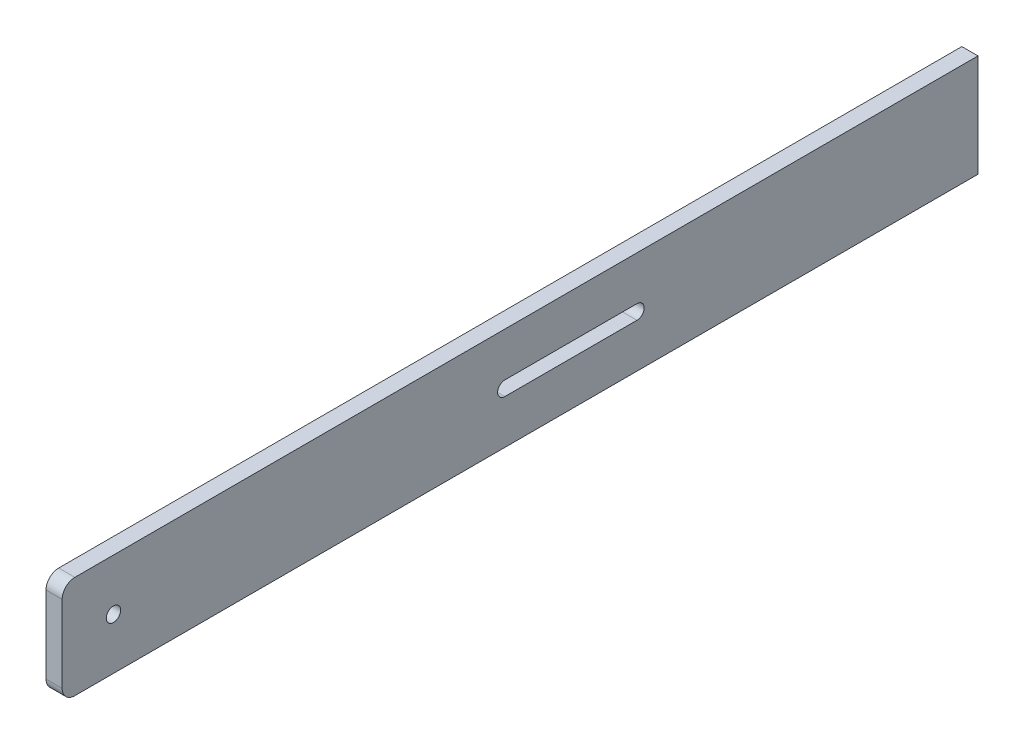
ISO-10303-21;
HEADER;
FILE_DESCRIPTION(('STEP AP214'),'2;1');
FILE_NAME('part.step','',(''),(''),'','','');
FILE_SCHEMA(('AUTOMOTIVE_DESIGN { 1 0 10303 214 1 1 1 1 }'));
ENDSEC;
DATA;
#1=APPLICATION_CONTEXT('core data for automotive mechanical design processes');
#2=APPLICATION_PROTOCOL_DEFINITION('international standard','automotive_design',2000,#1);
#3=PRODUCT_CONTEXT('',#1,'mechanical');
#4=PRODUCT('Part','Part','',(#3));
#5=PRODUCT_RELATED_PRODUCT_CATEGORY('part','',(#4));
#6=PRODUCT_DEFINITION_FORMATION('','',#4);
#7=PRODUCT_DEFINITION_CONTEXT('part definition',#1,'design');
#8=PRODUCT_DEFINITION('design','',#6,#7);
#9=PRODUCT_DEFINITION_SHAPE('','',#8);
#10=(LENGTH_UNIT() NAMED_UNIT(*) SI_UNIT(.MILLI.,.METRE.));
#11=(NAMED_UNIT(*) PLANE_ANGLE_UNIT() SI_UNIT($,.RADIAN.));
#12=(NAMED_UNIT(*) SI_UNIT($,.STERADIAN.) SOLID_ANGLE_UNIT());
#13=UNCERTAINTY_MEASURE_WITH_UNIT(LENGTH_MEASURE(1.E-05),#10,'distance_accuracy_value','');
#14=(GEOMETRIC_REPRESENTATION_CONTEXT(3) GLOBAL_UNCERTAINTY_ASSIGNED_CONTEXT((#13)) GLOBAL_UNIT_ASSIGNED_CONTEXT((#10,
#11,#12)) REPRESENTATION_CONTEXT('',''));
#15=CARTESIAN_POINT('',(0.,0.,0.));
#16=DIRECTION('',(0.,0.,1.));
#17=DIRECTION('',(1.,0.,0.));
#18=AXIS2_PLACEMENT_3D('',#15,#16,#17);
#19=CARTESIAN_POINT('',(1.5875,10.085,180.17));
#20=DIRECTION('',(-1.,0.,0.));
#21=DIRECTION('',(0.,-1.,0.));
#22=AXIS2_PLACEMENT_3D('',#19,#20,#21);
#23=PLANE('',#22);
#24=DIRECTION('',(0.,0.,-1.));
#25=VECTOR('',#24,1.);
#26=CARTESIAN_POINT('',(1.5875,1.415,180.17));
#27=LINE('',#26,#25);
#28=CARTESIAN_POINT('',(1.5875,1.415,93.085));
#29=VERTEX_POINT('',#28);
#30=CARTESIAN_POINT('',(1.5875,1.415,67.085));
#31=VERTEX_POINT('',#30);
#32=EDGE_CURVE('E296',#29,#31,#27,.T.);
#33=ORIENTED_EDGE('',*,*,#32,.T.);
#34=CARTESIAN_POINT('',(1.5875,0.,67.085));
#35=DIRECTION('',(-1.,0.,0.));
#36=DIRECTION('',(0.,-1.,0.));
#37=AXIS2_PLACEMENT_3D('',#34,#35,#36);
#38=CIRCLE('',#37,1.415);
#39=CARTESIAN_POINT('',(1.5875,-1.415,67.085));
#40=VERTEX_POINT('',#39);
#41=EDGE_CURVE('E166',#31,#40,#38,.T.);
#42=ORIENTED_EDGE('',*,*,#41,.T.);
#43=DIRECTION('',(0.,0.,1.));
#44=VECTOR('',#43,1.);
#45=CARTESIAN_POINT('',(1.5875,-1.415,180.17));
#46=LINE('',#45,#44);
#47=CARTESIAN_POINT('',(1.5875,-1.415,93.085));
#48=VERTEX_POINT('',#47);
#49=EDGE_CURVE('E301',#40,#48,#46,.T.);
#50=ORIENTED_EDGE('',*,*,#49,.T.);
#51=CARTESIAN_POINT('',(1.5875,0.,93.085));
#52=DIRECTION('',(-1.,0.,0.));
#53=DIRECTION('',(0.,-1.,0.));
#54=AXIS2_PLACEMENT_3D('',#51,#52,#53);
#55=CIRCLE('',#54,1.415);
#56=EDGE_CURVE('E125',#48,#29,#55,.T.);
#57=ORIENTED_EDGE('',*,*,#56,.T.);
#58=EDGE_LOOP('',(#33,#42,#50,#57));
#59=FACE_BOUND('',#58,.T.);
#60=CARTESIAN_POINT('',(1.5875,0.,170.08));
#61=DIRECTION('',(1.,0.,0.));
#62=DIRECTION('',(0.,0.,-1.));
#63=AXIS2_PLACEMENT_3D('',#60,#61,#62);
#64=CIRCLE('',#63,1.415);
#65=CARTESIAN_POINT('',(1.5875,0.,168.665));
#66=VERTEX_POINT('',#65);
#67=EDGE_CURVE('E165',#66,#66,#64,.T.);
#68=ORIENTED_EDGE('',*,*,#67,.F.);
#69=EDGE_LOOP('',(#68));
#70=FACE_BOUND('',#69,.T.);
#71=DIRECTION('',(0.,1.,0.));
#72=VECTOR('',#71,1.);
#73=CARTESIAN_POINT('',(1.5875,10.085,180.17));
#74=LINE('',#73,#72);
#75=CARTESIAN_POINT('',(1.5875,-7.585,180.17));
#76=VERTEX_POINT('',#75);
#77=CARTESIAN_POINT('',(1.5875,7.585,180.17));
#78=VERTEX_POINT('',#77);
#79=EDGE_CURVE('E171',#76,#78,#74,.T.);
#80=ORIENTED_EDGE('',*,*,#79,.F.);
#81=CARTESIAN_POINT('',(1.5875,-7.585,177.67));
#82=DIRECTION('',(-1.,0.,0.));
#83=DIRECTION('',(0.,-1.,0.));
#84=AXIS2_PLACEMENT_3D('',#81,#82,#83);
#85=CIRCLE('',#84,2.5);
#86=CARTESIAN_POINT('',(1.5875,-10.085,177.67));
#87=VERTEX_POINT('',#86);
#88=EDGE_CURVE('E205',#76,#87,#85,.F.);
#89=ORIENTED_EDGE('',*,*,#88,.T.);
#90=DIRECTION('',(0.,0.,-1.));
#91=VECTOR('',#90,1.);
#92=CARTESIAN_POINT('',(1.5875,-10.085,180.17));
#93=LINE('',#92,#91);
#94=CARTESIAN_POINT('',(1.5875,-10.085,0.));
#95=VERTEX_POINT('',#94);
#96=EDGE_CURVE('E181',#87,#95,#93,.T.);
#97=ORIENTED_EDGE('',*,*,#96,.T.);
#98=DIRECTION('',(0.,1.,0.));
#99=VECTOR('',#98,1.);
#100=CARTESIAN_POINT('',(1.5875,10.085,0.));
#101=LINE('',#100,#99);
#102=CARTESIAN_POINT('',(1.5875,10.085,0.));
#103=VERTEX_POINT('',#102);
#104=EDGE_CURVE('E164',#95,#103,#101,.T.);
#105=ORIENTED_EDGE('',*,*,#104,.T.);
#106=DIRECTION('',(0.,0.,-1.));
#107=VECTOR('',#106,1.);
#108=CARTESIAN_POINT('',(1.5875,10.085,180.17));
#109=LINE('',#108,#107);
#110=CARTESIAN_POINT('',(1.5875,10.085,177.67));
#111=VERTEX_POINT('',#110);
#112=EDGE_CURVE('E188',#111,#103,#109,.T.);
#113=ORIENTED_EDGE('',*,*,#112,.F.);
#114=CARTESIAN_POINT('',(1.5875,7.585,177.67));
#115=DIRECTION('',(-1.,0.,0.));
#116=DIRECTION('',(0.,-1.,0.));
#117=AXIS2_PLACEMENT_3D('',#114,#115,#116);
#118=CIRCLE('',#117,2.5);
#119=EDGE_CURVE('E202',#111,#78,#118,.F.);
#120=ORIENTED_EDGE('',*,*,#119,.T.);
#121=EDGE_LOOP('',(#80,#89,#97,#105,#113,#120));
#122=FACE_BOUND('',#121,.T.);
#123=ADVANCED_FACE('F42',(#59,#70,#122),#23,.F.);
#124=CARTESIAN_POINT('',(-1.5875,10.085,180.17));
#125=DIRECTION('',(0.,-1.,0.));
#126=DIRECTION('',(0.,0.,-1.));
#127=AXIS2_PLACEMENT_3D('',#124,#125,#126);
#128=PLANE('',#127);
#129=DIRECTION('',(0.,0.,-1.));
#130=VECTOR('',#129,1.);
#131=CARTESIAN_POINT('',(-1.5875,10.085,180.17));
#132=LINE('',#131,#130);
#133=CARTESIAN_POINT('',(-1.5875,10.085,177.67));
#134=VERTEX_POINT('',#133);
#135=CARTESIAN_POINT('',(-1.5875,10.085,0.));
#136=VERTEX_POINT('',#135);
#137=EDGE_CURVE('E184',#134,#136,#132,.T.);
#138=ORIENTED_EDGE('',*,*,#137,.F.);
#139=DIRECTION('',(-1.,0.,0.));
#140=VECTOR('',#139,1.);
#141=CARTESIAN_POINT('',(1.5875,10.085,177.67));
#142=LINE('',#141,#140);
#143=EDGE_CURVE('E12',#134,#111,#142,.F.);
#144=ORIENTED_EDGE('',*,*,#143,.T.);
#145=ORIENTED_EDGE('',*,*,#112,.T.);
#146=DIRECTION('',(-1.,0.,0.));
#147=VECTOR('',#146,1.);
#148=CARTESIAN_POINT('',(-1.5875,10.085,0.));
#149=LINE('',#148,#147);
#150=EDGE_CURVE('E242',#103,#136,#149,.T.);
#151=ORIENTED_EDGE('',*,*,#150,.T.);
#152=EDGE_LOOP('',(#138,#144,#145,#151));
#153=FACE_BOUND('',#152,.T.);
#154=ADVANCED_FACE('F255',(#153),#128,.F.);
#155=CARTESIAN_POINT('',(-1.5875,10.085,180.17));
#156=DIRECTION('',(1.,0.,0.));
#157=DIRECTION('',(0.,1.,0.));
#158=AXIS2_PLACEMENT_3D('',#155,#156,#157);
#159=PLANE('',#158);
#160=DIRECTION('',(0.,0.,1.));
#161=VECTOR('',#160,1.);
#162=CARTESIAN_POINT('',(-1.5875,-1.415,67.085));
#163=LINE('',#162,#161);
#164=CARTESIAN_POINT('',(-1.5875,-1.415,67.085));
#165=VERTEX_POINT('',#164);
#166=CARTESIAN_POINT('',(-1.5875,-1.415,93.085));
#167=VERTEX_POINT('',#166);
#168=EDGE_CURVE('E132',#165,#167,#163,.T.);
#169=ORIENTED_EDGE('',*,*,#168,.F.);
#170=CARTESIAN_POINT('',(-1.5875,0.,67.085));
#171=DIRECTION('',(-1.,0.,0.));
#172=DIRECTION('',(0.,-1.,0.));
#173=AXIS2_PLACEMENT_3D('',#170,#171,#172);
#174=CIRCLE('',#173,1.415);
#175=CARTESIAN_POINT('',(-1.5875,1.415,67.085));
#176=VERTEX_POINT('',#175);
#177=EDGE_CURVE('E66',#176,#165,#174,.T.);
#178=ORIENTED_EDGE('',*,*,#177,.F.);
#179=DIRECTION('',(0.,0.,-1.));
#180=VECTOR('',#179,1.);
#181=CARTESIAN_POINT('',(-1.5875,1.415,67.085));
#182=LINE('',#181,#180);
#183=CARTESIAN_POINT('',(-1.5875,1.415,93.085));
#184=VERTEX_POINT('',#183);
#185=EDGE_CURVE('E140',#184,#176,#182,.T.);
#186=ORIENTED_EDGE('',*,*,#185,.F.);
#187=CARTESIAN_POINT('',(-1.5875,0.,93.085));
#188=DIRECTION('',(-1.,0.,0.));
#189=DIRECTION('',(0.,-1.,0.));
#190=AXIS2_PLACEMENT_3D('',#187,#188,#189);
#191=CIRCLE('',#190,1.415);
#192=EDGE_CURVE('E122',#167,#184,#191,.T.);
#193=ORIENTED_EDGE('',*,*,#192,.F.);
#194=EDGE_LOOP('',(#169,#178,#186,#193));
#195=FACE_BOUND('',#194,.T.);
#196=CARTESIAN_POINT('',(-1.5875,0.,170.08));
#197=DIRECTION('',(1.,0.,0.));
#198=DIRECTION('',(0.,0.,-1.));
#199=AXIS2_PLACEMENT_3D('',#196,#197,#198);
#200=CIRCLE('',#199,1.415);
#201=CARTESIAN_POINT('',(-1.5875,0.,168.665));
#202=VERTEX_POINT('',#201);
#203=EDGE_CURVE('E158',#202,#202,#200,.T.);
#204=ORIENTED_EDGE('',*,*,#203,.T.);
#205=EDGE_LOOP('',(#204));
#206=FACE_BOUND('',#205,.T.);
#207=DIRECTION('',(0.,0.,-1.));
#208=VECTOR('',#207,1.);
#209=CARTESIAN_POINT('',(-1.5875,-10.085,180.17));
#210=LINE('',#209,#208);
#211=CARTESIAN_POINT('',(-1.5875,-10.085,177.67));
#212=VERTEX_POINT('',#211);
#213=CARTESIAN_POINT('',(-1.5875,-10.085,0.));
#214=VERTEX_POINT('',#213);
#215=EDGE_CURVE('E189',#212,#214,#210,.T.);
#216=ORIENTED_EDGE('',*,*,#215,.F.);
#217=CARTESIAN_POINT('',(-1.5875,-7.585,177.67));
#218=DIRECTION('',(1.,0.,0.));
#219=DIRECTION('',(0.,1.,0.));
#220=AXIS2_PLACEMENT_3D('',#217,#218,#219);
#221=CIRCLE('',#220,2.5);
#222=CARTESIAN_POINT('',(-1.5875,-7.585,180.17));
#223=VERTEX_POINT('',#222);
#224=EDGE_CURVE('E51',#212,#223,#221,.F.);
#225=ORIENTED_EDGE('',*,*,#224,.T.);
#226=DIRECTION('',(0.,-1.,0.));
#227=VECTOR('',#226,1.);
#228=CARTESIAN_POINT('',(-1.5875,10.085,180.17));
#229=LINE('',#228,#227);
#230=CARTESIAN_POINT('',(-1.5875,7.585,180.17));
#231=VERTEX_POINT('',#230);
#232=EDGE_CURVE('E175',#231,#223,#229,.T.);
#233=ORIENTED_EDGE('',*,*,#232,.F.);
#234=CARTESIAN_POINT('',(-1.5875,7.585,177.67));
#235=DIRECTION('',(1.,0.,0.));
#236=DIRECTION('',(0.,1.,0.));
#237=AXIS2_PLACEMENT_3D('',#234,#235,#236);
#238=CIRCLE('',#237,2.5);
#239=EDGE_CURVE('E211',#231,#134,#238,.F.);
#240=ORIENTED_EDGE('',*,*,#239,.T.);
#241=ORIENTED_EDGE('',*,*,#137,.T.);
#242=DIRECTION('',(0.,-1.,0.));
#243=VECTOR('',#242,1.);
#244=CARTESIAN_POINT('',(-1.5875,10.085,0.));
#245=LINE('',#244,#243);
#246=EDGE_CURVE('E239',#136,#214,#245,.T.);
#247=ORIENTED_EDGE('',*,*,#246,.T.);
#248=EDGE_LOOP('',(#216,#225,#233,#240,#241,#247));
#249=FACE_BOUND('',#248,.T.);
#250=ADVANCED_FACE('F137',(#195,#206,#249),#159,.F.);
#251=CARTESIAN_POINT('',(-1.5875,-10.085,180.17));
#252=DIRECTION('',(0.,1.,0.));
#253=DIRECTION('',(0.,0.,1.));
#254=AXIS2_PLACEMENT_3D('',#251,#252,#253);
#255=PLANE('',#254);
#256=ORIENTED_EDGE('',*,*,#96,.F.);
#257=DIRECTION('',(1.,0.,0.));
#258=VECTOR('',#257,1.);
#259=CARTESIAN_POINT('',(-1.5875,-10.085,177.67));
#260=LINE('',#259,#258);
#261=EDGE_CURVE('E208',#87,#212,#260,.F.);
#262=ORIENTED_EDGE('',*,*,#261,.T.);
#263=ORIENTED_EDGE('',*,*,#215,.T.);
#264=DIRECTION('',(1.,0.,0.));
#265=VECTOR('',#264,1.);
#266=CARTESIAN_POINT('',(-1.5875,-10.085,0.));
#267=LINE('',#266,#265);
#268=EDGE_CURVE('E176',#214,#95,#267,.T.);
#269=ORIENTED_EDGE('',*,*,#268,.T.);
#270=EDGE_LOOP('',(#256,#262,#263,#269));
#271=FACE_BOUND('',#270,.T.);
#272=ADVANCED_FACE('F232',(#271),#255,.F.);
#273=CARTESIAN_POINT('',(0.,0.,180.17));
#274=DIRECTION('',(0.,0.,1.));
#275=DIRECTION('',(1.,0.,0.));
#276=AXIS2_PLACEMENT_3D('',#273,#274,#275);
#277=PLANE('',#276);
#278=ORIENTED_EDGE('',*,*,#232,.T.);
#279=DIRECTION('',(1.,0.,0.));
#280=VECTOR('',#279,1.);
#281=CARTESIAN_POINT('',(1.5875,-7.585,180.17));
#282=LINE('',#281,#280);
#283=EDGE_CURVE('E198',#223,#76,#282,.T.);
#284=ORIENTED_EDGE('',*,*,#283,.T.);
#285=ORIENTED_EDGE('',*,*,#79,.T.);
#286=DIRECTION('',(-1.,0.,0.));
#287=VECTOR('',#286,1.);
#288=CARTESIAN_POINT('',(-1.5875,7.585,180.17));
#289=LINE('',#288,#287);
#290=EDGE_CURVE('E194',#78,#231,#289,.T.);
#291=ORIENTED_EDGE('',*,*,#290,.T.);
#292=EDGE_LOOP('',(#278,#284,#285,#291));
#293=FACE_BOUND('',#292,.T.);
#294=ADVANCED_FACE('F223',(#293),#277,.T.);
#295=CARTESIAN_POINT('',(0.,0.,0.));
#296=DIRECTION('',(0.,0.,1.));
#297=DIRECTION('',(1.,0.,0.));
#298=AXIS2_PLACEMENT_3D('',#295,#296,#297);
#299=PLANE('',#298);
#300=ORIENTED_EDGE('',*,*,#104,.F.);
#301=ORIENTED_EDGE('',*,*,#268,.F.);
#302=ORIENTED_EDGE('',*,*,#246,.F.);
#303=ORIENTED_EDGE('',*,*,#150,.F.);
#304=EDGE_LOOP('',(#300,#301,#302,#303));
#305=FACE_BOUND('',#304,.T.);
#306=ADVANCED_FACE('F253',(#305),#299,.F.);
#307=CARTESIAN_POINT('',(-1.5875,0.,170.08));
#308=DIRECTION('',(1.,0.,0.));
#309=DIRECTION('',(0.,0.,-1.));
#310=AXIS2_PLACEMENT_3D('',#307,#308,#309);
#311=CYLINDRICAL_SURFACE('',#310,1.415);
#312=ORIENTED_EDGE('',*,*,#203,.F.);
#313=EDGE_LOOP('',(#312));
#314=FACE_BOUND('',#313,.T.);
#315=ORIENTED_EDGE('',*,*,#67,.T.);
#316=EDGE_LOOP('',(#315));
#317=FACE_BOUND('',#316,.T.);
#318=ADVANCED_FACE('F265',(#314,#317),#311,.F.);
#319=CARTESIAN_POINT('',(0.,-7.585,177.67));
#320=DIRECTION('',(-1.,0.,0.));
#321=DIRECTION('',(0.,0.,1.));
#322=AXIS2_PLACEMENT_3D('',#319,#320,#321);
#323=CYLINDRICAL_SURFACE('',#322,2.5);
#324=ORIENTED_EDGE('',*,*,#224,.F.);
#325=ORIENTED_EDGE('',*,*,#261,.F.);
#326=ORIENTED_EDGE('',*,*,#88,.F.);
#327=ORIENTED_EDGE('',*,*,#283,.F.);
#328=EDGE_LOOP('',(#324,#325,#326,#327));
#329=FACE_BOUND('',#328,.T.);
#330=ADVANCED_FACE('F226',(#329),#323,.T.);
#331=CARTESIAN_POINT('',(0.,7.585,177.67));
#332=DIRECTION('',(1.,0.,0.));
#333=DIRECTION('',(0.,0.,-1.));
#334=AXIS2_PLACEMENT_3D('',#331,#332,#333);
#335=CYLINDRICAL_SURFACE('',#334,2.5);
#336=ORIENTED_EDGE('',*,*,#119,.F.);
#337=ORIENTED_EDGE('',*,*,#143,.F.);
#338=ORIENTED_EDGE('',*,*,#239,.F.);
#339=ORIENTED_EDGE('',*,*,#290,.F.);
#340=EDGE_LOOP('',(#336,#337,#338,#339));
#341=FACE_BOUND('',#340,.T.);
#342=ADVANCED_FACE('F44',(#341),#335,.T.);
#343=CARTESIAN_POINT('',(8.4125,0.,67.085));
#344=DIRECTION('',(-1.,0.,0.));
#345=DIRECTION('',(0.,-1.,0.));
#346=AXIS2_PLACEMENT_3D('',#343,#344,#345);
#347=CYLINDRICAL_SURFACE('',#346,1.415);
#348=DIRECTION('',(-1.,0.,0.));
#349=VECTOR('',#348,1.);
#350=CARTESIAN_POINT('',(8.4125,1.415,67.085));
#351=LINE('',#350,#349);
#352=EDGE_CURVE('E298',#31,#176,#351,.T.);
#353=ORIENTED_EDGE('',*,*,#352,.T.);
#354=ORIENTED_EDGE('',*,*,#177,.T.);
#355=DIRECTION('',(-1.,0.,0.));
#356=VECTOR('',#355,1.);
#357=CARTESIAN_POINT('',(8.4125,-1.415,67.085));
#358=LINE('',#357,#356);
#359=EDGE_CURVE('E129',#40,#165,#358,.T.);
#360=ORIENTED_EDGE('',*,*,#359,.F.);
#361=ORIENTED_EDGE('',*,*,#41,.F.);
#362=EDGE_LOOP('',(#353,#354,#360,#361));
#363=FACE_BOUND('',#362,.T.);
#364=ADVANCED_FACE('F258',(#363),#347,.F.);
#365=CARTESIAN_POINT('',(8.4125,1.415,67.085));
#366=DIRECTION('',(0.,1.,0.));
#367=DIRECTION('',(-1.,0.,0.));
#368=AXIS2_PLACEMENT_3D('',#365,#366,#367);
#369=PLANE('',#368);
#370=DIRECTION('',(-1.,0.,0.));
#371=VECTOR('',#370,1.);
#372=CARTESIAN_POINT('',(8.4125,1.415,93.085));
#373=LINE('',#372,#371);
#374=EDGE_CURVE('E128',#29,#184,#373,.T.);
#375=ORIENTED_EDGE('',*,*,#374,.T.);
#376=ORIENTED_EDGE('',*,*,#185,.T.);
#377=ORIENTED_EDGE('',*,*,#352,.F.);
#378=ORIENTED_EDGE('',*,*,#32,.F.);
#379=EDGE_LOOP('',(#375,#376,#377,#378));
#380=FACE_BOUND('',#379,.T.);
#381=ADVANCED_FACE('F263',(#380),#369,.F.);
#382=CARTESIAN_POINT('',(8.4125,0.,93.085));
#383=DIRECTION('',(-1.,0.,0.));
#384=DIRECTION('',(0.,-1.,0.));
#385=AXIS2_PLACEMENT_3D('',#382,#383,#384);
#386=CYLINDRICAL_SURFACE('',#385,1.415);
#387=DIRECTION('',(-1.,0.,0.));
#388=VECTOR('',#387,1.);
#389=CARTESIAN_POINT('',(8.4125,-1.415,93.085));
#390=LINE('',#389,#388);
#391=EDGE_CURVE('E58',#48,#167,#390,.T.);
#392=ORIENTED_EDGE('',*,*,#391,.T.);
#393=ORIENTED_EDGE('',*,*,#192,.T.);
#394=ORIENTED_EDGE('',*,*,#374,.F.);
#395=ORIENTED_EDGE('',*,*,#56,.F.);
#396=EDGE_LOOP('',(#392,#393,#394,#395));
#397=FACE_BOUND('',#396,.T.);
#398=ADVANCED_FACE('F119',(#397),#386,.F.);
#399=CARTESIAN_POINT('',(8.4125,-1.415,67.085));
#400=DIRECTION('',(0.,-1.,0.));
#401=DIRECTION('',(1.,0.,0.));
#402=AXIS2_PLACEMENT_3D('',#399,#400,#401);
#403=PLANE('',#402);
#404=ORIENTED_EDGE('',*,*,#359,.T.);
#405=ORIENTED_EDGE('',*,*,#168,.T.);
#406=ORIENTED_EDGE('',*,*,#391,.F.);
#407=ORIENTED_EDGE('',*,*,#49,.F.);
#408=EDGE_LOOP('',(#404,#405,#406,#407));
#409=FACE_BOUND('',#408,.T.);
#410=ADVANCED_FACE('F133',(#409),#403,.F.);
#411=CLOSED_SHELL('',(#123,#154,#250,#272,#294,#306,#318,#330,#342,#364,#381,#398,#410));
#412=MANIFOLD_SOLID_BREP('B2',#411);
#413=ADVANCED_BREP_SHAPE_REPRESENTATION('',(#18,#412),#14);
#414=SHAPE_DEFINITION_REPRESENTATION(#9,#413);
ENDSEC;
END-ISO-10303-21;
